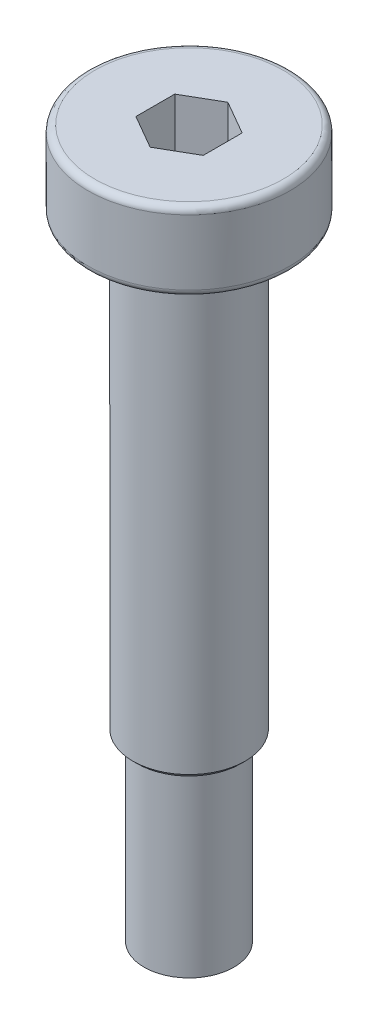
ISO-10303-21;
HEADER;
FILE_DESCRIPTION(('STEP AP214'),'2;1');
FILE_NAME('part.step','',(''),(''),'','','');
FILE_SCHEMA(('AUTOMOTIVE_DESIGN { 1 0 10303 214 1 1 1 1 }'));
ENDSEC;
DATA;
#1=APPLICATION_CONTEXT('core data for automotive mechanical design processes');
#2=APPLICATION_PROTOCOL_DEFINITION('international standard','automotive_design',2000,#1);
#3=PRODUCT_CONTEXT('',#1,'mechanical');
#4=PRODUCT('Part','Part','',(#3));
#5=PRODUCT_RELATED_PRODUCT_CATEGORY('part','',(#4));
#6=PRODUCT_DEFINITION_FORMATION('','',#4);
#7=PRODUCT_DEFINITION_CONTEXT('part definition',#1,'design');
#8=PRODUCT_DEFINITION('design','',#6,#7);
#9=PRODUCT_DEFINITION_SHAPE('','',#8);
#10=(LENGTH_UNIT() NAMED_UNIT(*) SI_UNIT(.MILLI.,.METRE.));
#11=(NAMED_UNIT(*) PLANE_ANGLE_UNIT() SI_UNIT($,.RADIAN.));
#12=(NAMED_UNIT(*) SI_UNIT($,.STERADIAN.) SOLID_ANGLE_UNIT());
#13=UNCERTAINTY_MEASURE_WITH_UNIT(LENGTH_MEASURE(1.E-05),#10,'distance_accuracy_value','');
#14=(GEOMETRIC_REPRESENTATION_CONTEXT(3) GLOBAL_UNCERTAINTY_ASSIGNED_CONTEXT((#13)) GLOBAL_UNIT_ASSIGNED_CONTEXT((#10,
#11,#12)) REPRESENTATION_CONTEXT('',''));
#15=CARTESIAN_POINT('',(0.,0.,0.));
#16=DIRECTION('',(0.,0.,1.));
#17=DIRECTION('',(1.,0.,0.));
#18=AXIS2_PLACEMENT_3D('',#15,#16,#17);
#19=CARTESIAN_POINT('',(0.,3.5,0.));
#20=DIRECTION('',(0.,1.,0.));
#21=DIRECTION('',(-1.,0.,0.));
#22=AXIS2_PLACEMENT_3D('',#19,#20,#21);
#23=CYLINDRICAL_SURFACE('',#22,4.5);
#24=CARTESIAN_POINT('',(0.,0.3,0.));
#25=DIRECTION('',(0.,-1.,0.));
#26=DIRECTION('',(1.,0.,0.));
#27=AXIS2_PLACEMENT_3D('',#24,#25,#26);
#28=CIRCLE('',#27,4.5);
#29=CARTESIAN_POINT('',(4.5,0.3,0.));
#30=VERTEX_POINT('',#29);
#31=EDGE_CURVE('E135',#30,#30,#28,.F.);
#32=ORIENTED_EDGE('',*,*,#31,.T.);
#33=EDGE_LOOP('',(#32));
#34=FACE_BOUND('',#33,.T.);
#35=CARTESIAN_POINT('',(0.,3.2,0.));
#36=DIRECTION('',(0.,1.,0.));
#37=DIRECTION('',(-1.,0.,0.));
#38=AXIS2_PLACEMENT_3D('',#35,#36,#37);
#39=CIRCLE('',#38,4.5);
#40=CARTESIAN_POINT('',(-4.5,3.2,0.));
#41=VERTEX_POINT('',#40);
#42=EDGE_CURVE('E132',#41,#41,#39,.F.);
#43=ORIENTED_EDGE('',*,*,#42,.T.);
#44=EDGE_LOOP('',(#43));
#45=FACE_BOUND('',#44,.T.);
#46=ADVANCED_FACE('F16',(#34,#45),#23,.T.);
#47=CARTESIAN_POINT('',(-4.5,0.,0.));
#48=DIRECTION('',(0.,-1.,0.));
#49=DIRECTION('',(1.,0.,0.));
#50=AXIS2_PLACEMENT_3D('',#47,#48,#49);
#51=PLANE('',#50);
#52=CARTESIAN_POINT('',(0.,0.,0.));
#53=DIRECTION('',(0.,-1.,0.));
#54=DIRECTION('',(1.,0.,0.));
#55=AXIS2_PLACEMENT_3D('',#52,#53,#54);
#56=CIRCLE('',#55,4.2);
#57=CARTESIAN_POINT('',(4.2,0.,0.));
#58=VERTEX_POINT('',#57);
#59=EDGE_CURVE('E138',#58,#58,#56,.T.);
#60=ORIENTED_EDGE('',*,*,#59,.T.);
#61=EDGE_LOOP('',(#60));
#62=FACE_BOUND('',#61,.T.);
#63=CARTESIAN_POINT('',(0.,0.,0.));
#64=DIRECTION('',(0.,1.,0.));
#65=DIRECTION('',(-1.,0.,0.));
#66=AXIS2_PLACEMENT_3D('',#63,#64,#65);
#67=CIRCLE('',#66,2.5);
#68=CARTESIAN_POINT('',(-2.5,0.,0.));
#69=VERTEX_POINT('',#68);
#70=EDGE_CURVE('E129',#69,#69,#67,.T.);
#71=ORIENTED_EDGE('',*,*,#70,.T.);
#72=EDGE_LOOP('',(#71));
#73=FACE_BOUND('',#72,.T.);
#74=ADVANCED_FACE('F159',(#62,#73),#51,.T.);
#75=CARTESIAN_POINT('',(0.,3.5,0.));
#76=DIRECTION('',(0.,1.,0.));
#77=DIRECTION('',(-1.,0.,0.));
#78=AXIS2_PLACEMENT_3D('',#75,#76,#77);
#79=CYLINDRICAL_SURFACE('',#78,2.5);
#80=CARTESIAN_POINT('',(0.,-19.8,0.));
#81=DIRECTION('',(0.,-1.,0.));
#82=DIRECTION('',(1.,0.,0.));
#83=AXIS2_PLACEMENT_3D('',#80,#81,#82);
#84=CIRCLE('',#83,2.5);
#85=CARTESIAN_POINT('',(2.5,-19.8,0.));
#86=VERTEX_POINT('',#85);
#87=EDGE_CURVE('E24',#86,#86,#84,.F.);
#88=ORIENTED_EDGE('',*,*,#87,.T.);
#89=EDGE_LOOP('',(#88));
#90=FACE_BOUND('',#89,.T.);
#91=ORIENTED_EDGE('',*,*,#70,.F.);
#92=EDGE_LOOP('',(#91));
#93=FACE_BOUND('',#92,.T.);
#94=ADVANCED_FACE('F146',(#90,#93),#79,.T.);
#95=CARTESIAN_POINT('',(-2.5,-20.,0.));
#96=DIRECTION('',(0.,-1.,0.));
#97=DIRECTION('',(1.,0.,0.));
#98=AXIS2_PLACEMENT_3D('',#95,#96,#97);
#99=PLANE('',#98);
#100=CARTESIAN_POINT('',(0.,-20.,0.));
#101=DIRECTION('',(0.,-1.,0.));
#102=DIRECTION('',(1.,0.,0.));
#103=AXIS2_PLACEMENT_3D('',#100,#101,#102);
#104=CIRCLE('',#103,2.3);
#105=CARTESIAN_POINT('',(2.3,-20.,0.));
#106=VERTEX_POINT('',#105);
#107=EDGE_CURVE('E11',#106,#106,#104,.T.);
#108=ORIENTED_EDGE('',*,*,#107,.T.);
#109=EDGE_LOOP('',(#108));
#110=FACE_BOUND('',#109,.T.);
#111=CARTESIAN_POINT('',(0.,-20.,0.));
#112=DIRECTION('',(0.,1.,0.));
#113=DIRECTION('',(-1.,0.,0.));
#114=AXIS2_PLACEMENT_3D('',#111,#112,#113);
#115=CIRCLE('',#114,2.);
#116=CARTESIAN_POINT('',(-2.,-20.,0.));
#117=VERTEX_POINT('',#116);
#118=EDGE_CURVE('E126',#117,#117,#115,.T.);
#119=ORIENTED_EDGE('',*,*,#118,.T.);
#120=EDGE_LOOP('',(#119));
#121=FACE_BOUND('',#120,.T.);
#122=ADVANCED_FACE('F201',(#110,#121),#99,.T.);
#123=CARTESIAN_POINT('',(0.,3.5,0.));
#124=DIRECTION('',(0.,1.,0.));
#125=DIRECTION('',(-1.,0.,0.));
#126=AXIS2_PLACEMENT_3D('',#123,#124,#125);
#127=CYLINDRICAL_SURFACE('',#126,2.);
#128=CARTESIAN_POINT('',(0.,-28.,0.));
#129=DIRECTION('',(0.,1.,0.));
#130=DIRECTION('',(-1.,0.,0.));
#131=AXIS2_PLACEMENT_3D('',#128,#129,#130);
#132=CIRCLE('',#131,2.);
#133=CARTESIAN_POINT('',(-2.,-28.,0.));
#134=VERTEX_POINT('',#133);
#135=EDGE_CURVE('E118',#134,#134,#132,.T.);
#136=ORIENTED_EDGE('',*,*,#135,.T.);
#137=EDGE_LOOP('',(#136));
#138=FACE_BOUND('',#137,.T.);
#139=ORIENTED_EDGE('',*,*,#118,.F.);
#140=EDGE_LOOP('',(#139));
#141=FACE_BOUND('',#140,.T.);
#142=ADVANCED_FACE('F194',(#138,#141),#127,.T.);
#143=CARTESIAN_POINT('',(-2.,-28.,0.));
#144=DIRECTION('',(0.,-1.,0.));
#145=DIRECTION('',(1.,0.,0.));
#146=AXIS2_PLACEMENT_3D('',#143,#144,#145);
#147=PLANE('',#146);
#148=ORIENTED_EDGE('',*,*,#135,.F.);
#149=EDGE_LOOP('',(#148));
#150=FACE_BOUND('',#149,.T.);
#151=ADVANCED_FACE('F188',(#150),#147,.T.);
#152=CARTESIAN_POINT('',(0.,3.5,0.));
#153=DIRECTION('',(0.,1.,0.));
#154=DIRECTION('',(-1.,0.,0.));
#155=AXIS2_PLACEMENT_3D('',#152,#153,#154);
#156=PLANE('',#155);
#157=DIRECTION('',(-0.866025403784439,0.,-0.5));
#158=VECTOR('',#157,1.);
#159=CARTESIAN_POINT('',(1.5,3.5,-0.866025403784439));
#160=LINE('',#159,#158);
#161=CARTESIAN_POINT('',(1.5,3.5,-0.866025403784439));
#162=VERTEX_POINT('',#161);
#163=CARTESIAN_POINT('',(0.,3.5,-1.73205080756887));
#164=VERTEX_POINT('',#163);
#165=EDGE_CURVE('E31',#162,#164,#160,.T.);
#166=ORIENTED_EDGE('',*,*,#165,.F.);
#167=DIRECTION('',(0.,0.,-1.));
#168=VECTOR('',#167,1.);
#169=CARTESIAN_POINT('',(1.5,3.5,0.86602540378444));
#170=LINE('',#169,#168);
#171=CARTESIAN_POINT('',(1.5,3.5,0.86602540378444));
#172=VERTEX_POINT('',#171);
#173=EDGE_CURVE('E114',#172,#162,#170,.T.);
#174=ORIENTED_EDGE('',*,*,#173,.F.);
#175=DIRECTION('',(0.866025403784439,0.,-0.5));
#176=VECTOR('',#175,1.);
#177=CARTESIAN_POINT('',(0.,3.5,1.73205080756888));
#178=LINE('',#177,#176);
#179=CARTESIAN_POINT('',(0.,3.5,1.73205080756888));
#180=VERTEX_POINT('',#179);
#181=EDGE_CURVE('E112',#180,#172,#178,.T.);
#182=ORIENTED_EDGE('',*,*,#181,.F.);
#183=DIRECTION('',(0.866025403784439,0.,0.5));
#184=VECTOR('',#183,1.);
#185=CARTESIAN_POINT('',(-1.5,3.5,0.866025403784439));
#186=LINE('',#185,#184);
#187=CARTESIAN_POINT('',(-1.5,3.5,0.866025403784439));
#188=VERTEX_POINT('',#187);
#189=EDGE_CURVE('E79',#188,#180,#186,.T.);
#190=ORIENTED_EDGE('',*,*,#189,.F.);
#191=DIRECTION('',(0.,0.,1.));
#192=VECTOR('',#191,1.);
#193=CARTESIAN_POINT('',(-1.5,3.5,-0.866025403784438));
#194=LINE('',#193,#192);
#195=CARTESIAN_POINT('',(-1.5,3.5,-0.866025403784438));
#196=VERTEX_POINT('',#195);
#197=EDGE_CURVE('E108',#196,#188,#194,.T.);
#198=ORIENTED_EDGE('',*,*,#197,.F.);
#199=DIRECTION('',(-0.866025403784439,0.,0.5));
#200=VECTOR('',#199,1.);
#201=CARTESIAN_POINT('',(0.,3.5,-1.73205080756887));
#202=LINE('',#201,#200);
#203=EDGE_CURVE('E105',#164,#196,#202,.T.);
#204=ORIENTED_EDGE('',*,*,#203,.F.);
#205=EDGE_LOOP('',(#166,#174,#182,#190,#198,#204));
#206=FACE_BOUND('',#205,.T.);
#207=CARTESIAN_POINT('',(0.,3.5,0.));
#208=DIRECTION('',(0.,1.,0.));
#209=DIRECTION('',(-1.,0.,0.));
#210=AXIS2_PLACEMENT_3D('',#207,#208,#209);
#211=CIRCLE('',#210,4.2);
#212=CARTESIAN_POINT('',(-4.2,3.5,0.));
#213=VERTEX_POINT('',#212);
#214=EDGE_CURVE('E141',#213,#213,#211,.T.);
#215=ORIENTED_EDGE('',*,*,#214,.T.);
#216=EDGE_LOOP('',(#215));
#217=FACE_BOUND('',#216,.T.);
#218=ADVANCED_FACE('F173',(#206,#217),#156,.T.);
#219=CARTESIAN_POINT('',(0.,0.3,0.));
#220=DIRECTION('',(0.,-1.,0.));
#221=DIRECTION('',(1.,0.,0.));
#222=AXIS2_PLACEMENT_3D('',#219,#220,#221);
#223=TOROIDAL_SURFACE('',#222,4.2,0.3);
#224=ORIENTED_EDGE('',*,*,#59,.F.);
#225=EDGE_LOOP('',(#224));
#226=FACE_BOUND('',#225,.T.);
#227=ORIENTED_EDGE('',*,*,#31,.F.);
#228=EDGE_LOOP('',(#227));
#229=FACE_BOUND('',#228,.T.);
#230=ADVANCED_FACE('F170',(#226,#229),#223,.T.);
#231=CARTESIAN_POINT('',(0.,3.2,0.));
#232=DIRECTION('',(0.,1.,0.));
#233=DIRECTION('',(-1.,0.,0.));
#234=AXIS2_PLACEMENT_3D('',#231,#232,#233);
#235=TOROIDAL_SURFACE('',#234,4.2,0.3);
#236=ORIENTED_EDGE('',*,*,#42,.F.);
#237=EDGE_LOOP('',(#236));
#238=FACE_BOUND('',#237,.T.);
#239=ORIENTED_EDGE('',*,*,#214,.F.);
#240=EDGE_LOOP('',(#239));
#241=FACE_BOUND('',#240,.T.);
#242=ADVANCED_FACE('F172',(#238,#241),#235,.T.);
#243=CARTESIAN_POINT('',(1.5,1.1,-0.866025403784439));
#244=DIRECTION('',(0.5,0.,-0.866025403784439));
#245=DIRECTION('',(-0.866025403784439,0.,-0.5));
#246=AXIS2_PLACEMENT_3D('',#243,#244,#245);
#247=PLANE('',#246);
#248=ORIENTED_EDGE('',*,*,#165,.T.);
#249=DIRECTION('',(0.,1.,0.));
#250=VECTOR('',#249,1.);
#251=CARTESIAN_POINT('',(0.,1.1,-1.73205080756887));
#252=LINE('',#251,#250);
#253=CARTESIAN_POINT('',(0.,1.1,-1.73205080756887));
#254=VERTEX_POINT('',#253);
#255=EDGE_CURVE('E61',#254,#164,#252,.T.);
#256=ORIENTED_EDGE('',*,*,#255,.F.);
#257=DIRECTION('',(-0.866025403784439,0.,-0.5));
#258=VECTOR('',#257,1.);
#259=CARTESIAN_POINT('',(1.5,1.1,-0.866025403784439));
#260=LINE('',#259,#258);
#261=CARTESIAN_POINT('',(1.5,1.1,-0.866025403784439));
#262=VERTEX_POINT('',#261);
#263=EDGE_CURVE('E116',#262,#254,#260,.T.);
#264=ORIENTED_EDGE('',*,*,#263,.F.);
#265=DIRECTION('',(0.,1.,0.));
#266=VECTOR('',#265,1.);
#267=CARTESIAN_POINT('',(1.5,1.1,-0.866025403784439));
#268=LINE('',#267,#266);
#269=EDGE_CURVE('E39',#262,#162,#268,.T.);
#270=ORIENTED_EDGE('',*,*,#269,.T.);
#271=EDGE_LOOP('',(#248,#256,#264,#270));
#272=FACE_BOUND('',#271,.T.);
#273=ADVANCED_FACE('F176',(#272),#247,.F.);
#274=CARTESIAN_POINT('',(1.5,1.1,0.86602540378444));
#275=DIRECTION('',(1.,0.,0.));
#276=DIRECTION('',(0.,1.,0.));
#277=AXIS2_PLACEMENT_3D('',#274,#275,#276);
#278=PLANE('',#277);
#279=ORIENTED_EDGE('',*,*,#173,.T.);
#280=ORIENTED_EDGE('',*,*,#269,.F.);
#281=DIRECTION('',(0.,0.,-1.));
#282=VECTOR('',#281,1.);
#283=CARTESIAN_POINT('',(1.5,1.1,0.86602540378444));
#284=LINE('',#283,#282);
#285=CARTESIAN_POINT('',(1.5,1.1,0.86602540378444));
#286=VERTEX_POINT('',#285);
#287=EDGE_CURVE('E91',#286,#262,#284,.T.);
#288=ORIENTED_EDGE('',*,*,#287,.F.);
#289=DIRECTION('',(0.,1.,0.));
#290=VECTOR('',#289,1.);
#291=CARTESIAN_POINT('',(1.5,1.1,0.86602540378444));
#292=LINE('',#291,#290);
#293=EDGE_CURVE('E83',#286,#172,#292,.T.);
#294=ORIENTED_EDGE('',*,*,#293,.T.);
#295=EDGE_LOOP('',(#279,#280,#288,#294));
#296=FACE_BOUND('',#295,.T.);
#297=ADVANCED_FACE('F181',(#296),#278,.F.);
#298=CARTESIAN_POINT('',(0.,1.1,1.73205080756888));
#299=DIRECTION('',(0.5,0.,0.866025403784439));
#300=DIRECTION('',(0.866025403784439,0.,-0.5));
#301=AXIS2_PLACEMENT_3D('',#298,#299,#300);
#302=PLANE('',#301);
#303=ORIENTED_EDGE('',*,*,#181,.T.);
#304=ORIENTED_EDGE('',*,*,#293,.F.);
#305=DIRECTION('',(0.866025403784439,0.,-0.5));
#306=VECTOR('',#305,1.);
#307=CARTESIAN_POINT('',(0.,1.1,1.73205080756888));
#308=LINE('',#307,#306);
#309=CARTESIAN_POINT('',(0.,1.1,1.73205080756888));
#310=VERTEX_POINT('',#309);
#311=EDGE_CURVE('E87',#310,#286,#308,.T.);
#312=ORIENTED_EDGE('',*,*,#311,.F.);
#313=DIRECTION('',(0.,1.,0.));
#314=VECTOR('',#313,1.);
#315=CARTESIAN_POINT('',(0.,1.1,1.73205080756888));
#316=LINE('',#315,#314);
#317=EDGE_CURVE('E72',#310,#180,#316,.T.);
#318=ORIENTED_EDGE('',*,*,#317,.T.);
#319=EDGE_LOOP('',(#303,#304,#312,#318));
#320=FACE_BOUND('',#319,.T.);
#321=ADVANCED_FACE('F88',(#320),#302,.F.);
#322=CARTESIAN_POINT('',(-1.5,1.1,0.866025403784439));
#323=DIRECTION('',(-0.5,0.,0.866025403784438));
#324=DIRECTION('',(0.866025403784439,0.,0.5));
#325=AXIS2_PLACEMENT_3D('',#322,#323,#324);
#326=PLANE('',#325);
#327=ORIENTED_EDGE('',*,*,#189,.T.);
#328=ORIENTED_EDGE('',*,*,#317,.F.);
#329=DIRECTION('',(0.866025403784439,0.,0.5));
#330=VECTOR('',#329,1.);
#331=CARTESIAN_POINT('',(-1.5,1.1,0.866025403784439));
#332=LINE('',#331,#330);
#333=CARTESIAN_POINT('',(-1.5,1.1,0.866025403784439));
#334=VERTEX_POINT('',#333);
#335=EDGE_CURVE('E76',#334,#310,#332,.T.);
#336=ORIENTED_EDGE('',*,*,#335,.F.);
#337=DIRECTION('',(0.,1.,0.));
#338=VECTOR('',#337,1.);
#339=CARTESIAN_POINT('',(-1.5,1.1,0.866025403784439));
#340=LINE('',#339,#338);
#341=EDGE_CURVE('E84',#334,#188,#340,.T.);
#342=ORIENTED_EDGE('',*,*,#341,.T.);
#343=EDGE_LOOP('',(#327,#328,#336,#342));
#344=FACE_BOUND('',#343,.T.);
#345=ADVANCED_FACE('F74',(#344),#326,.F.);
#346=CARTESIAN_POINT('',(-1.5,1.1,-0.866025403784438));
#347=DIRECTION('',(-1.,0.,0.));
#348=DIRECTION('',(0.,-1.,0.));
#349=AXIS2_PLACEMENT_3D('',#346,#347,#348);
#350=PLANE('',#349);
#351=ORIENTED_EDGE('',*,*,#197,.T.);
#352=ORIENTED_EDGE('',*,*,#341,.F.);
#353=DIRECTION('',(0.,0.,1.));
#354=VECTOR('',#353,1.);
#355=CARTESIAN_POINT('',(-1.5,1.1,-0.866025403784438));
#356=LINE('',#355,#354);
#357=CARTESIAN_POINT('',(-1.5,1.1,-0.866025403784438));
#358=VERTEX_POINT('',#357);
#359=EDGE_CURVE('E97',#358,#334,#356,.T.);
#360=ORIENTED_EDGE('',*,*,#359,.F.);
#361=DIRECTION('',(0.,1.,0.));
#362=VECTOR('',#361,1.);
#363=CARTESIAN_POINT('',(-1.5,1.1,-0.866025403784438));
#364=LINE('',#363,#362);
#365=EDGE_CURVE('E121',#358,#196,#364,.T.);
#366=ORIENTED_EDGE('',*,*,#365,.T.);
#367=EDGE_LOOP('',(#351,#352,#360,#366));
#368=FACE_BOUND('',#367,.T.);
#369=ADVANCED_FACE('F280',(#368),#350,.F.);
#370=CARTESIAN_POINT('',(0.,1.1,-1.73205080756887));
#371=DIRECTION('',(-0.5,0.,-0.866025403784439));
#372=DIRECTION('',(-0.866025403784439,0.,0.5));
#373=AXIS2_PLACEMENT_3D('',#370,#371,#372);
#374=PLANE('',#373);
#375=ORIENTED_EDGE('',*,*,#203,.T.);
#376=ORIENTED_EDGE('',*,*,#365,.F.);
#377=DIRECTION('',(-0.866025403784439,0.,0.5));
#378=VECTOR('',#377,1.);
#379=CARTESIAN_POINT('',(0.,1.1,-1.73205080756887));
#380=LINE('',#379,#378);
#381=EDGE_CURVE('E99',#254,#358,#380,.T.);
#382=ORIENTED_EDGE('',*,*,#381,.F.);
#383=ORIENTED_EDGE('',*,*,#255,.T.);
#384=EDGE_LOOP('',(#375,#376,#382,#383));
#385=FACE_BOUND('',#384,.T.);
#386=ADVANCED_FACE('F155',(#385),#374,.F.);
#387=CARTESIAN_POINT('',(0.,1.1,0.));
#388=DIRECTION('',(0.,1.,0.));
#389=DIRECTION('',(0.,0.,1.));
#390=AXIS2_PLACEMENT_3D('',#387,#388,#389);
#391=PLANE('',#390);
#392=ORIENTED_EDGE('',*,*,#263,.T.);
#393=ORIENTED_EDGE('',*,*,#381,.T.);
#394=ORIENTED_EDGE('',*,*,#359,.T.);
#395=ORIENTED_EDGE('',*,*,#335,.T.);
#396=ORIENTED_EDGE('',*,*,#311,.T.);
#397=ORIENTED_EDGE('',*,*,#287,.T.);
#398=EDGE_LOOP('',(#392,#393,#394,#395,#396,#397));
#399=FACE_BOUND('',#398,.T.);
#400=ADVANCED_FACE('F94',(#399),#391,.T.);
#401=CARTESIAN_POINT('',(0.,-19.8,0.));
#402=DIRECTION('',(0.,1.,0.));
#403=DIRECTION('',(-1.,0.,0.));
#404=AXIS2_PLACEMENT_3D('',#401,#402,#403);
#405=CONICAL_SURFACE('',#404,2.5,0.785398163397453);
#406=ORIENTED_EDGE('',*,*,#107,.F.);
#407=EDGE_LOOP('',(#406));
#408=FACE_BOUND('',#407,.T.);
#409=ORIENTED_EDGE('',*,*,#87,.F.);
#410=EDGE_LOOP('',(#409));
#411=FACE_BOUND('',#410,.T.);
#412=ADVANCED_FACE('F18',(#408,#411),#405,.T.);
#413=CLOSED_SHELL('',(#46,#74,#94,#122,#142,#151,#218,#230,#242,#273,#297,#321,#345,#369,#386,
#400,#412));
#414=MANIFOLD_SOLID_BREP('B1',#413);
#415=ADVANCED_BREP_SHAPE_REPRESENTATION('',(#18,#414),#14);
#416=SHAPE_DEFINITION_REPRESENTATION(#9,#415);
ENDSEC;
END-ISO-10303-21;
